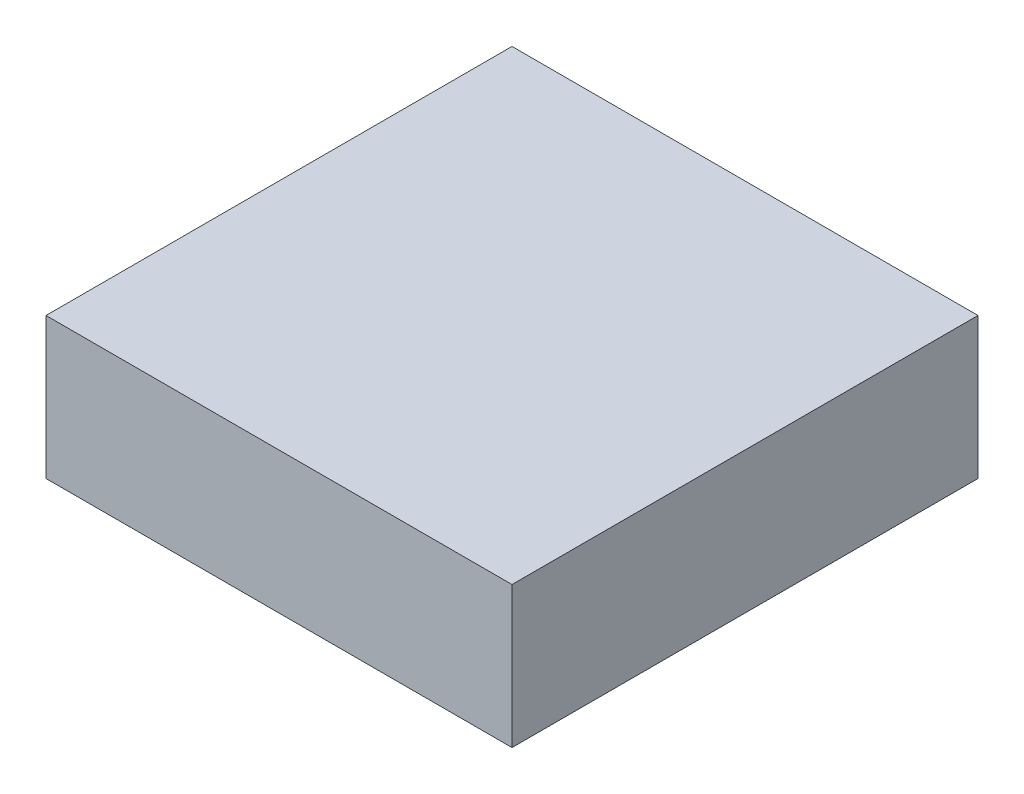
ISO-10303-21;
HEADER;
FILE_DESCRIPTION(('STEP AP214'),'2;1');
FILE_NAME('part.step','',(''),(''),'','','');
FILE_SCHEMA(('AUTOMOTIVE_DESIGN { 1 0 10303 214 1 1 1 1 }'));
ENDSEC;
DATA;
#1=APPLICATION_CONTEXT('core data for automotive mechanical design processes');
#2=APPLICATION_PROTOCOL_DEFINITION('international standard','automotive_design',2000,#1);
#3=PRODUCT_CONTEXT('',#1,'mechanical');
#4=PRODUCT('Part','Part','',(#3));
#5=PRODUCT_RELATED_PRODUCT_CATEGORY('part','',(#4));
#6=PRODUCT_DEFINITION_FORMATION('','',#4);
#7=PRODUCT_DEFINITION_CONTEXT('part definition',#1,'design');
#8=PRODUCT_DEFINITION('design','',#6,#7);
#9=PRODUCT_DEFINITION_SHAPE('','',#8);
#10=(LENGTH_UNIT() NAMED_UNIT(*) SI_UNIT(.MILLI.,.METRE.));
#11=(NAMED_UNIT(*) PLANE_ANGLE_UNIT() SI_UNIT($,.RADIAN.));
#12=(NAMED_UNIT(*) SI_UNIT($,.STERADIAN.) SOLID_ANGLE_UNIT());
#13=UNCERTAINTY_MEASURE_WITH_UNIT(LENGTH_MEASURE(1.E-05),#10,'distance_accuracy_value','');
#14=(GEOMETRIC_REPRESENTATION_CONTEXT(3) GLOBAL_UNCERTAINTY_ASSIGNED_CONTEXT((#13)) GLOBAL_UNIT_ASSIGNED_CONTEXT((#10,
#11,#12)) REPRESENTATION_CONTEXT('',''));
#15=CARTESIAN_POINT('',(0.,0.,0.));
#16=DIRECTION('',(0.,0.,1.));
#17=DIRECTION('',(1.,0.,0.));
#18=AXIS2_PLACEMENT_3D('',#15,#16,#17);
#19=CARTESIAN_POINT('',(33.85,-1.85,-18.025));
#20=DIRECTION('',(0.,-1.,0.));
#21=DIRECTION('',(1.,0.,0.));
#22=AXIS2_PLACEMENT_3D('',#19,#20,#21);
#23=PLANE('',#22);
#24=DIRECTION('',(1.,0.,0.));
#25=VECTOR('',#24,1.);
#26=CARTESIAN_POINT('',(35.5,-1.85,-14.725));
#27=LINE('',#26,#25);
#28=CARTESIAN_POINT('',(33.85,-1.85,-14.725));
#29=VERTEX_POINT('',#28);
#30=CARTESIAN_POINT('',(37.15,-1.85,-14.725));
#31=VERTEX_POINT('',#30);
#32=EDGE_CURVE('E54',#29,#31,#27,.T.);
#33=ORIENTED_EDGE('',*,*,#32,.F.);
#34=DIRECTION('',(0.,0.,1.));
#35=VECTOR('',#34,1.);
#36=CARTESIAN_POINT('',(33.85,-1.85,-16.375));
#37=LINE('',#36,#35);
#38=CARTESIAN_POINT('',(33.85,-1.85,-18.025));
#39=VERTEX_POINT('',#38);
#40=EDGE_CURVE('E69',#39,#29,#37,.T.);
#41=ORIENTED_EDGE('',*,*,#40,.F.);
#42=DIRECTION('',(-1.,0.,0.));
#43=VECTOR('',#42,1.);
#44=CARTESIAN_POINT('',(35.5,-1.85,-18.025));
#45=LINE('',#44,#43);
#46=CARTESIAN_POINT('',(37.15,-1.85,-18.025));
#47=VERTEX_POINT('',#46);
#48=EDGE_CURVE('E21',#47,#39,#45,.T.);
#49=ORIENTED_EDGE('',*,*,#48,.F.);
#50=DIRECTION('',(0.,0.,-1.));
#51=VECTOR('',#50,1.);
#52=CARTESIAN_POINT('',(37.15,-1.85,-16.375));
#53=LINE('',#52,#51);
#54=EDGE_CURVE('E59',#31,#47,#53,.T.);
#55=ORIENTED_EDGE('',*,*,#54,.F.);
#56=EDGE_LOOP('',(#33,#41,#49,#55));
#57=FACE_BOUND('',#56,.T.);
#58=ADVANCED_FACE('F17',(#57),#23,.T.);
#59=CARTESIAN_POINT('',(33.85,-0.85,-18.025));
#60=DIRECTION('',(0.,0.,-1.));
#61=DIRECTION('',(1.,0.,0.));
#62=AXIS2_PLACEMENT_3D('',#59,#60,#61);
#63=PLANE('',#62);
#64=ORIENTED_EDGE('',*,*,#48,.T.);
#65=DIRECTION('',(0.,-1.,0.));
#66=VECTOR('',#65,1.);
#67=CARTESIAN_POINT('',(33.85,-1.35,-18.025));
#68=LINE('',#67,#66);
#69=CARTESIAN_POINT('',(33.85,-0.85,-18.025));
#70=VERTEX_POINT('',#69);
#71=EDGE_CURVE('E80',#70,#39,#68,.T.);
#72=ORIENTED_EDGE('',*,*,#71,.F.);
#73=DIRECTION('',(1.,0.,0.));
#74=VECTOR('',#73,1.);
#75=CARTESIAN_POINT('',(35.5,-0.85,-18.025));
#76=LINE('',#75,#74);
#77=CARTESIAN_POINT('',(37.15,-0.85,-18.025));
#78=VERTEX_POINT('',#77);
#79=EDGE_CURVE('E75',#70,#78,#76,.T.);
#80=ORIENTED_EDGE('',*,*,#79,.T.);
#81=DIRECTION('',(0.,1.,0.));
#82=VECTOR('',#81,1.);
#83=CARTESIAN_POINT('',(37.15,-1.35,-18.025));
#84=LINE('',#83,#82);
#85=EDGE_CURVE('E64',#47,#78,#84,.T.);
#86=ORIENTED_EDGE('',*,*,#85,.F.);
#87=EDGE_LOOP('',(#64,#72,#80,#86));
#88=FACE_BOUND('',#87,.T.);
#89=ADVANCED_FACE('F74',(#88),#63,.T.);
#90=CARTESIAN_POINT('',(37.15,-0.85,-18.025));
#91=DIRECTION('',(1.,0.,0.));
#92=DIRECTION('',(0.,0.,1.));
#93=AXIS2_PLACEMENT_3D('',#90,#91,#92);
#94=PLANE('',#93);
#95=ORIENTED_EDGE('',*,*,#54,.T.);
#96=ORIENTED_EDGE('',*,*,#85,.T.);
#97=DIRECTION('',(0.,0.,1.));
#98=VECTOR('',#97,1.);
#99=CARTESIAN_POINT('',(37.15,-0.85,-16.375));
#100=LINE('',#99,#98);
#101=CARTESIAN_POINT('',(37.15,-0.85,-14.725));
#102=VERTEX_POINT('',#101);
#103=EDGE_CURVE('E85',#78,#102,#100,.T.);
#104=ORIENTED_EDGE('',*,*,#103,.T.);
#105=DIRECTION('',(0.,1.,0.));
#106=VECTOR('',#105,1.);
#107=CARTESIAN_POINT('',(37.15,-1.35,-14.725));
#108=LINE('',#107,#106);
#109=EDGE_CURVE('E66',#31,#102,#108,.T.);
#110=ORIENTED_EDGE('',*,*,#109,.F.);
#111=EDGE_LOOP('',(#95,#96,#104,#110));
#112=FACE_BOUND('',#111,.T.);
#113=ADVANCED_FACE('F61',(#112),#94,.T.);
#114=CARTESIAN_POINT('',(37.15,-0.85,-14.725));
#115=DIRECTION('',(0.,0.,1.));
#116=DIRECTION('',(-1.,0.,0.));
#117=AXIS2_PLACEMENT_3D('',#114,#115,#116);
#118=PLANE('',#117);
#119=ORIENTED_EDGE('',*,*,#32,.T.);
#120=ORIENTED_EDGE('',*,*,#109,.T.);
#121=DIRECTION('',(-1.,0.,0.));
#122=VECTOR('',#121,1.);
#123=CARTESIAN_POINT('',(35.5,-0.85,-14.725));
#124=LINE('',#123,#122);
#125=CARTESIAN_POINT('',(33.85,-0.85,-14.725));
#126=VERTEX_POINT('',#125);
#127=EDGE_CURVE('E27',#102,#126,#124,.T.);
#128=ORIENTED_EDGE('',*,*,#127,.T.);
#129=DIRECTION('',(0.,1.,0.));
#130=VECTOR('',#129,1.);
#131=CARTESIAN_POINT('',(33.85,-1.35,-14.725));
#132=LINE('',#131,#130);
#133=EDGE_CURVE('E35',#29,#126,#132,.T.);
#134=ORIENTED_EDGE('',*,*,#133,.F.);
#135=EDGE_LOOP('',(#119,#120,#128,#134));
#136=FACE_BOUND('',#135,.T.);
#137=ADVANCED_FACE('F89',(#136),#118,.T.);
#138=CARTESIAN_POINT('',(33.85,-0.85,-14.725));
#139=DIRECTION('',(-1.,0.,0.));
#140=DIRECTION('',(0.,0.,-1.));
#141=AXIS2_PLACEMENT_3D('',#138,#139,#140);
#142=PLANE('',#141);
#143=ORIENTED_EDGE('',*,*,#40,.T.);
#144=ORIENTED_EDGE('',*,*,#133,.T.);
#145=DIRECTION('',(0.,0.,-1.));
#146=VECTOR('',#145,1.);
#147=CARTESIAN_POINT('',(33.85,-0.85,-16.375));
#148=LINE('',#147,#146);
#149=EDGE_CURVE('E11',#126,#70,#148,.T.);
#150=ORIENTED_EDGE('',*,*,#149,.T.);
#151=ORIENTED_EDGE('',*,*,#71,.T.);
#152=EDGE_LOOP('',(#143,#144,#150,#151));
#153=FACE_BOUND('',#152,.T.);
#154=ADVANCED_FACE('F91',(#153),#142,.T.);
#155=CARTESIAN_POINT('',(33.85,-0.85,-18.025));
#156=DIRECTION('',(0.,-1.,0.));
#157=DIRECTION('',(1.,0.,0.));
#158=AXIS2_PLACEMENT_3D('',#155,#156,#157);
#159=PLANE('',#158);
#160=ORIENTED_EDGE('',*,*,#127,.F.);
#161=ORIENTED_EDGE('',*,*,#103,.F.);
#162=ORIENTED_EDGE('',*,*,#79,.F.);
#163=ORIENTED_EDGE('',*,*,#149,.F.);
#164=EDGE_LOOP('',(#160,#161,#162,#163));
#165=FACE_BOUND('',#164,.T.);
#166=ADVANCED_FACE('F19',(#165),#159,.F.);
#167=CLOSED_SHELL('',(#58,#89,#113,#137,#154,#166));
#168=MANIFOLD_SOLID_BREP('B1',#167);
#169=ADVANCED_BREP_SHAPE_REPRESENTATION('',(#18,#168),#14);
#170=SHAPE_DEFINITION_REPRESENTATION(#9,#169);
ENDSEC;
END-ISO-10303-21;
